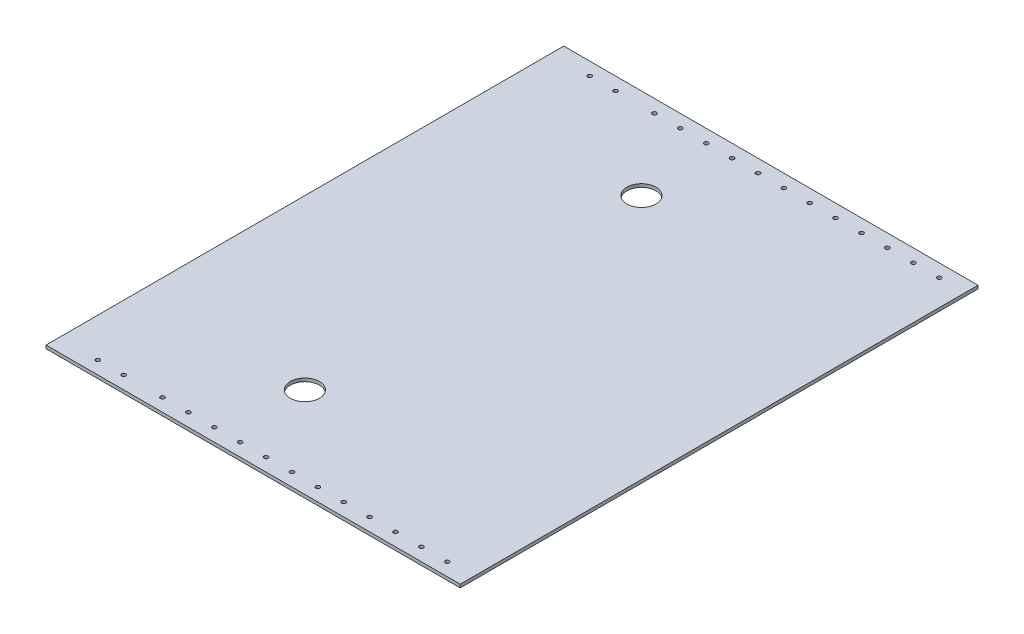
ISO-10303-21;
HEADER;
FILE_DESCRIPTION(('STEP AP214'),'2;1');
FILE_NAME('part.step','',(''),(''),'','','');
FILE_SCHEMA(('AUTOMOTIVE_DESIGN { 1 0 10303 214 1 1 1 1 }'));
ENDSEC;
DATA;
#1=APPLICATION_CONTEXT('core data for automotive mechanical design processes');
#2=APPLICATION_PROTOCOL_DEFINITION('international standard','automotive_design',2000,#1);
#3=PRODUCT_CONTEXT('',#1,'mechanical');
#4=PRODUCT('Part','Part','',(#3));
#5=PRODUCT_RELATED_PRODUCT_CATEGORY('part','',(#4));
#6=PRODUCT_DEFINITION_FORMATION('','',#4);
#7=PRODUCT_DEFINITION_CONTEXT('part definition',#1,'design');
#8=PRODUCT_DEFINITION('design','',#6,#7);
#9=PRODUCT_DEFINITION_SHAPE('','',#8);
#10=(LENGTH_UNIT() NAMED_UNIT(*) SI_UNIT(.MILLI.,.METRE.));
#11=(NAMED_UNIT(*) PLANE_ANGLE_UNIT() SI_UNIT($,.RADIAN.));
#12=(NAMED_UNIT(*) SI_UNIT($,.STERADIAN.) SOLID_ANGLE_UNIT());
#13=UNCERTAINTY_MEASURE_WITH_UNIT(LENGTH_MEASURE(1.E-05),#10,'distance_accuracy_value','');
#14=(GEOMETRIC_REPRESENTATION_CONTEXT(3) GLOBAL_UNCERTAINTY_ASSIGNED_CONTEXT((#13)) GLOBAL_UNIT_ASSIGNED_CONTEXT((#10,
#11,#12)) REPRESENTATION_CONTEXT('',''));
#15=CARTESIAN_POINT('',(0.,0.,0.));
#16=DIRECTION('',(0.,0.,1.));
#17=DIRECTION('',(1.,0.,0.));
#18=AXIS2_PLACEMENT_3D('',#15,#16,#17);
#19=CARTESIAN_POINT('',(0.,3.175,0.));
#20=DIRECTION('',(0.,0.,-1.));
#21=DIRECTION('',(-1.,0.,0.));
#22=AXIS2_PLACEMENT_3D('',#19,#20,#21);
#23=PLANE('',#22);
#24=DIRECTION('',(0.,1.,0.));
#25=VECTOR('',#24,1.);
#26=CARTESIAN_POINT('',(165.1,3.175,0.));
#27=LINE('',#26,#25);
#28=CARTESIAN_POINT('',(165.1,0.,0.));
#29=VERTEX_POINT('',#28);
#30=CARTESIAN_POINT('',(165.1,3.175,0.));
#31=VERTEX_POINT('',#30);
#32=EDGE_CURVE('E274',#29,#31,#27,.T.);
#33=ORIENTED_EDGE('',*,*,#32,.F.);
#34=DIRECTION('',(1.,0.,0.));
#35=VECTOR('',#34,1.);
#36=CARTESIAN_POINT('',(0.,0.,0.));
#37=LINE('',#36,#35);
#38=CARTESIAN_POINT('',(571.5,0.,0.));
#39=VERTEX_POINT('',#38);
#40=EDGE_CURVE('E77',#29,#39,#37,.T.);
#41=ORIENTED_EDGE('',*,*,#40,.T.);
#42=DIRECTION('',(0.,-1.,0.));
#43=VECTOR('',#42,1.);
#44=CARTESIAN_POINT('',(571.5,3.175,0.));
#45=LINE('',#44,#43);
#46=CARTESIAN_POINT('',(571.5,3.175,0.));
#47=VERTEX_POINT('',#46);
#48=EDGE_CURVE('E39',#47,#39,#45,.T.);
#49=ORIENTED_EDGE('',*,*,#48,.F.);
#50=DIRECTION('',(1.,0.,0.));
#51=VECTOR('',#50,1.);
#52=CARTESIAN_POINT('',(0.,3.175,0.));
#53=LINE('',#52,#51);
#54=EDGE_CURVE('E85',#31,#47,#53,.T.);
#55=ORIENTED_EDGE('',*,*,#54,.F.);
#56=EDGE_LOOP('',(#33,#41,#49,#55));
#57=FACE_BOUND('',#56,.T.);
#58=ADVANCED_FACE('F32',(#57),#23,.F.);
#59=CARTESIAN_POINT('',(0.,3.175,-508.));
#60=DIRECTION('',(0.,0.,1.));
#61=DIRECTION('',(1.,0.,0.));
#62=AXIS2_PLACEMENT_3D('',#59,#60,#61);
#63=PLANE('',#62);
#64=DIRECTION('',(0.,-1.,0.));
#65=VECTOR('',#64,1.);
#66=CARTESIAN_POINT('',(165.1,3.175,-508.));
#67=LINE('',#66,#65);
#68=CARTESIAN_POINT('',(165.1,3.175,-508.));
#69=VERTEX_POINT('',#68);
#70=CARTESIAN_POINT('',(165.1,0.,-508.));
#71=VERTEX_POINT('',#70);
#72=EDGE_CURVE('E46',#69,#71,#67,.T.);
#73=ORIENTED_EDGE('',*,*,#72,.F.);
#74=DIRECTION('',(-1.,0.,0.));
#75=VECTOR('',#74,1.);
#76=CARTESIAN_POINT('',(0.,3.175,-508.));
#77=LINE('',#76,#75);
#78=CARTESIAN_POINT('',(571.5,3.175,-508.));
#79=VERTEX_POINT('',#78);
#80=EDGE_CURVE('E82',#79,#69,#77,.T.);
#81=ORIENTED_EDGE('',*,*,#80,.F.);
#82=DIRECTION('',(0.,-1.,0.));
#83=VECTOR('',#82,1.);
#84=CARTESIAN_POINT('',(571.5,3.175,-508.));
#85=LINE('',#84,#83);
#86=CARTESIAN_POINT('',(571.5,0.,-508.));
#87=VERTEX_POINT('',#86);
#88=EDGE_CURVE('E70',#79,#87,#85,.T.);
#89=ORIENTED_EDGE('',*,*,#88,.T.);
#90=DIRECTION('',(-1.,0.,0.));
#91=VECTOR('',#90,1.);
#92=CARTESIAN_POINT('',(0.,0.,-508.));
#93=LINE('',#92,#91);
#94=EDGE_CURVE('E76',#87,#71,#93,.T.);
#95=ORIENTED_EDGE('',*,*,#94,.T.);
#96=EDGE_LOOP('',(#73,#81,#89,#95));
#97=FACE_BOUND('',#96,.T.);
#98=ADVANCED_FACE('F81',(#97),#63,.F.);
#99=CARTESIAN_POINT('',(0.,3.175,0.));
#100=DIRECTION('',(0.,-1.,0.));
#101=DIRECTION('',(0.,0.,-1.));
#102=AXIS2_PLACEMENT_3D('',#99,#100,#101);
#103=PLANE('',#102);
#104=CARTESIAN_POINT('',(330.2,3.175,-88.9));
#105=DIRECTION('',(0.,1.,0.));
#106=DIRECTION('',(0.,0.,1.));
#107=AXIS2_PLACEMENT_3D('',#104,#105,#106);
#108=CIRCLE('',#107,14.2875);
#109=CARTESIAN_POINT('',(330.2,3.175,-74.6125));
#110=VERTEX_POINT('',#109);
#111=EDGE_CURVE('E93',#110,#110,#108,.T.);
#112=ORIENTED_EDGE('',*,*,#111,.F.);
#113=EDGE_LOOP('',(#112));
#114=FACE_BOUND('',#113,.T.);
#115=CARTESIAN_POINT('',(330.2,3.175,-419.1));
#116=DIRECTION('',(0.,1.,0.));
#117=DIRECTION('',(0.,0.,1.));
#118=AXIS2_PLACEMENT_3D('',#115,#116,#117);
#119=CIRCLE('',#118,14.2875);
#120=CARTESIAN_POINT('',(330.2,3.175,-404.8125));
#121=VERTEX_POINT('',#120);
#122=EDGE_CURVE('E100',#121,#121,#119,.T.);
#123=ORIENTED_EDGE('',*,*,#122,.F.);
#124=EDGE_LOOP('',(#123));
#125=FACE_BOUND('',#124,.T.);
#126=CARTESIAN_POINT('',(546.1,3.175,-495.3));
#127=DIRECTION('',(0.,1.,0.));
#128=DIRECTION('',(0.,0.,1.));
#129=AXIS2_PLACEMENT_3D('',#126,#127,#128);
#130=CIRCLE('',#129,2.01929999999992);
#131=CARTESIAN_POINT('',(546.1,3.175,-493.2807));
#132=VERTEX_POINT('',#131);
#133=EDGE_CURVE('E105',#132,#132,#130,.T.);
#134=ORIENTED_EDGE('',*,*,#133,.F.);
#135=EDGE_LOOP('',(#134));
#136=FACE_BOUND('',#135,.T.);
#137=CARTESIAN_POINT('',(546.1,3.175,-12.7));
#138=DIRECTION('',(0.,1.,0.));
#139=DIRECTION('',(0.,0.,-1.));
#140=AXIS2_PLACEMENT_3D('',#137,#138,#139);
#141=CIRCLE('',#140,2.01929999999992);
#142=CARTESIAN_POINT('',(546.1,3.175,-14.7192999999999));
#143=VERTEX_POINT('',#142);
#144=EDGE_CURVE('E207',#143,#143,#141,.T.);
#145=ORIENTED_EDGE('',*,*,#144,.F.);
#146=EDGE_LOOP('',(#145));
#147=FACE_BOUND('',#146,.T.);
#148=CARTESIAN_POINT('',(520.7,3.175,-12.7));
#149=DIRECTION('',(0.,1.,0.));
#150=DIRECTION('',(0.,0.,-1.));
#151=AXIS2_PLACEMENT_3D('',#148,#149,#150);
#152=CIRCLE('',#151,2.01929999999992);
#153=CARTESIAN_POINT('',(520.7,3.175,-14.7192999999999));
#154=VERTEX_POINT('',#153);
#155=EDGE_CURVE('E214',#154,#154,#152,.T.);
#156=ORIENTED_EDGE('',*,*,#155,.F.);
#157=EDGE_LOOP('',(#156));
#158=FACE_BOUND('',#157,.T.);
#159=CARTESIAN_POINT('',(495.3,3.175,-12.7));
#160=DIRECTION('',(0.,1.,0.));
#161=DIRECTION('',(0.,0.,-1.));
#162=AXIS2_PLACEMENT_3D('',#159,#160,#161);
#163=CIRCLE('',#162,2.01929999999992);
#164=CARTESIAN_POINT('',(495.3,3.175,-14.7192999999999));
#165=VERTEX_POINT('',#164);
#166=EDGE_CURVE('E220',#165,#165,#163,.T.);
#167=ORIENTED_EDGE('',*,*,#166,.F.);
#168=EDGE_LOOP('',(#167));
#169=FACE_BOUND('',#168,.T.);
#170=CARTESIAN_POINT('',(469.9,3.175,-12.7));
#171=DIRECTION('',(0.,1.,0.));
#172=DIRECTION('',(0.,0.,-1.));
#173=AXIS2_PLACEMENT_3D('',#170,#171,#172);
#174=CIRCLE('',#173,2.01929999999992);
#175=CARTESIAN_POINT('',(469.9,3.175,-14.7192999999999));
#176=VERTEX_POINT('',#175);
#177=EDGE_CURVE('E226',#176,#176,#174,.T.);
#178=ORIENTED_EDGE('',*,*,#177,.F.);
#179=EDGE_LOOP('',(#178));
#180=FACE_BOUND('',#179,.T.);
#181=CARTESIAN_POINT('',(444.5,3.175,-12.7));
#182=DIRECTION('',(0.,1.,0.));
#183=DIRECTION('',(0.,0.,-1.));
#184=AXIS2_PLACEMENT_3D('',#181,#182,#183);
#185=CIRCLE('',#184,2.01929999999992);
#186=CARTESIAN_POINT('',(444.5,3.175,-14.7192999999999));
#187=VERTEX_POINT('',#186);
#188=EDGE_CURVE('E232',#187,#187,#185,.T.);
#189=ORIENTED_EDGE('',*,*,#188,.F.);
#190=EDGE_LOOP('',(#189));
#191=FACE_BOUND('',#190,.T.);
#192=CARTESIAN_POINT('',(419.1,3.175,-12.7));
#193=DIRECTION('',(0.,1.,0.));
#194=DIRECTION('',(0.,0.,-1.));
#195=AXIS2_PLACEMENT_3D('',#192,#193,#194);
#196=CIRCLE('',#195,2.01929999999992);
#197=CARTESIAN_POINT('',(419.1,3.175,-14.7192999999999));
#198=VERTEX_POINT('',#197);
#199=EDGE_CURVE('E238',#198,#198,#196,.T.);
#200=ORIENTED_EDGE('',*,*,#199,.F.);
#201=EDGE_LOOP('',(#200));
#202=FACE_BOUND('',#201,.T.);
#203=CARTESIAN_POINT('',(393.7,3.175,-12.7));
#204=DIRECTION('',(0.,1.,0.));
#205=DIRECTION('',(0.,0.,-1.));
#206=AXIS2_PLACEMENT_3D('',#203,#204,#205);
#207=CIRCLE('',#206,2.01929999999992);
#208=CARTESIAN_POINT('',(393.7,3.175,-14.7192999999999));
#209=VERTEX_POINT('',#208);
#210=EDGE_CURVE('E244',#209,#209,#207,.T.);
#211=ORIENTED_EDGE('',*,*,#210,.F.);
#212=EDGE_LOOP('',(#211));
#213=FACE_BOUND('',#212,.T.);
#214=CARTESIAN_POINT('',(368.3,3.175,-12.7));
#215=DIRECTION('',(0.,1.,0.));
#216=DIRECTION('',(0.,0.,-1.));
#217=AXIS2_PLACEMENT_3D('',#214,#215,#216);
#218=CIRCLE('',#217,2.01929999999992);
#219=CARTESIAN_POINT('',(368.3,3.175,-14.7192999999999));
#220=VERTEX_POINT('',#219);
#221=EDGE_CURVE('E250',#220,#220,#218,.T.);
#222=ORIENTED_EDGE('',*,*,#221,.F.);
#223=EDGE_LOOP('',(#222));
#224=FACE_BOUND('',#223,.T.);
#225=CARTESIAN_POINT('',(342.9,3.175,-12.7));
#226=DIRECTION('',(0.,1.,0.));
#227=DIRECTION('',(0.,0.,-1.));
#228=AXIS2_PLACEMENT_3D('',#225,#226,#227);
#229=CIRCLE('',#228,2.01929999999992);
#230=CARTESIAN_POINT('',(342.9,3.175,-14.7192999999999));
#231=VERTEX_POINT('',#230);
#232=EDGE_CURVE('E256',#231,#231,#229,.T.);
#233=ORIENTED_EDGE('',*,*,#232,.F.);
#234=EDGE_LOOP('',(#233));
#235=FACE_BOUND('',#234,.T.);
#236=CARTESIAN_POINT('',(317.5,3.175,-12.7));
#237=DIRECTION('',(0.,1.,0.));
#238=DIRECTION('',(0.,0.,-1.));
#239=AXIS2_PLACEMENT_3D('',#236,#237,#238);
#240=CIRCLE('',#239,2.01929999999992);
#241=CARTESIAN_POINT('',(317.5,3.175,-14.7192999999999));
#242=VERTEX_POINT('',#241);
#243=EDGE_CURVE('E262',#242,#242,#240,.T.);
#244=ORIENTED_EDGE('',*,*,#243,.F.);
#245=EDGE_LOOP('',(#244));
#246=FACE_BOUND('',#245,.T.);
#247=CARTESIAN_POINT('',(292.1,3.175,-12.7));
#248=DIRECTION('',(0.,1.,0.));
#249=DIRECTION('',(0.,0.,-1.));
#250=AXIS2_PLACEMENT_3D('',#247,#248,#249);
#251=CIRCLE('',#250,2.01929999999992);
#252=CARTESIAN_POINT('',(292.1,3.175,-14.7192999999999));
#253=VERTEX_POINT('',#252);
#254=EDGE_CURVE('E268',#253,#253,#251,.T.);
#255=ORIENTED_EDGE('',*,*,#254,.F.);
#256=EDGE_LOOP('',(#255));
#257=FACE_BOUND('',#256,.T.);
#258=CARTESIAN_POINT('',(368.3,3.175,-495.3));
#259=DIRECTION('',(0.,1.,0.));
#260=DIRECTION('',(0.,0.,1.));
#261=AXIS2_PLACEMENT_3D('',#258,#259,#260);
#262=CIRCLE('',#261,2.01929999999992);
#263=CARTESIAN_POINT('',(368.3,3.175,-493.2807));
#264=VERTEX_POINT('',#263);
#265=EDGE_CURVE('E135',#264,#264,#262,.T.);
#266=ORIENTED_EDGE('',*,*,#265,.F.);
#267=EDGE_LOOP('',(#266));
#268=FACE_BOUND('',#267,.T.);
#269=CARTESIAN_POINT('',(393.7,3.175,-495.3));
#270=DIRECTION('',(0.,1.,0.));
#271=DIRECTION('',(0.,0.,1.));
#272=AXIS2_PLACEMENT_3D('',#269,#270,#271);
#273=CIRCLE('',#272,2.01929999999992);
#274=CARTESIAN_POINT('',(393.7,3.175,-493.2807));
#275=VERTEX_POINT('',#274);
#276=EDGE_CURVE('E142',#275,#275,#273,.T.);
#277=ORIENTED_EDGE('',*,*,#276,.F.);
#278=EDGE_LOOP('',(#277));
#279=FACE_BOUND('',#278,.T.);
#280=CARTESIAN_POINT('',(419.1,3.175,-495.3));
#281=DIRECTION('',(0.,1.,0.));
#282=DIRECTION('',(0.,0.,1.));
#283=AXIS2_PLACEMENT_3D('',#280,#281,#282);
#284=CIRCLE('',#283,2.01929999999992);
#285=CARTESIAN_POINT('',(419.1,3.175,-493.2807));
#286=VERTEX_POINT('',#285);
#287=EDGE_CURVE('E148',#286,#286,#284,.T.);
#288=ORIENTED_EDGE('',*,*,#287,.F.);
#289=EDGE_LOOP('',(#288));
#290=FACE_BOUND('',#289,.T.);
#291=CARTESIAN_POINT('',(444.5,3.175,-495.3));
#292=DIRECTION('',(0.,1.,0.));
#293=DIRECTION('',(0.,0.,1.));
#294=AXIS2_PLACEMENT_3D('',#291,#292,#293);
#295=CIRCLE('',#294,2.01929999999992);
#296=CARTESIAN_POINT('',(444.5,3.175,-493.2807));
#297=VERTEX_POINT('',#296);
#298=EDGE_CURVE('E154',#297,#297,#295,.T.);
#299=ORIENTED_EDGE('',*,*,#298,.F.);
#300=EDGE_LOOP('',(#299));
#301=FACE_BOUND('',#300,.T.);
#302=CARTESIAN_POINT('',(228.6,3.175,-495.3));
#303=DIRECTION('',(0.,1.,0.));
#304=DIRECTION('',(0.,0.,1.));
#305=AXIS2_PLACEMENT_3D('',#302,#303,#304);
#306=CIRCLE('',#305,2.0193);
#307=CARTESIAN_POINT('',(228.6,3.175,-493.2807));
#308=VERTEX_POINT('',#307);
#309=EDGE_CURVE('E118',#308,#308,#306,.T.);
#310=ORIENTED_EDGE('',*,*,#309,.F.);
#311=EDGE_LOOP('',(#310));
#312=FACE_BOUND('',#311,.T.);
#313=CARTESIAN_POINT('',(520.7,3.175,-495.3));
#314=DIRECTION('',(0.,1.,0.));
#315=DIRECTION('',(0.,0.,1.));
#316=AXIS2_PLACEMENT_3D('',#313,#314,#315);
#317=CIRCLE('',#316,2.01929999999992);
#318=CARTESIAN_POINT('',(520.7,3.175,-493.2807));
#319=VERTEX_POINT('',#318);
#320=EDGE_CURVE('E111',#319,#319,#317,.T.);
#321=ORIENTED_EDGE('',*,*,#320,.F.);
#322=EDGE_LOOP('',(#321));
#323=FACE_BOUND('',#322,.T.);
#324=CARTESIAN_POINT('',(495.3,3.175,-495.3));
#325=DIRECTION('',(0.,1.,0.));
#326=DIRECTION('',(0.,0.,1.));
#327=AXIS2_PLACEMENT_3D('',#324,#325,#326);
#328=CIRCLE('',#327,2.01929999999992);
#329=CARTESIAN_POINT('',(495.3,3.175,-493.2807));
#330=VERTEX_POINT('',#329);
#331=EDGE_CURVE('E130',#330,#330,#328,.T.);
#332=ORIENTED_EDGE('',*,*,#331,.F.);
#333=EDGE_LOOP('',(#332));
#334=FACE_BOUND('',#333,.T.);
#335=CARTESIAN_POINT('',(469.9,3.175,-495.3));
#336=DIRECTION('',(0.,1.,0.));
#337=DIRECTION('',(0.,0.,1.));
#338=AXIS2_PLACEMENT_3D('',#335,#336,#337);
#339=CIRCLE('',#338,2.01929999999992);
#340=CARTESIAN_POINT('',(469.9,3.175,-493.2807));
#341=VERTEX_POINT('',#340);
#342=EDGE_CURVE('E123',#341,#341,#339,.T.);
#343=ORIENTED_EDGE('',*,*,#342,.F.);
#344=EDGE_LOOP('',(#343));
#345=FACE_BOUND('',#344,.T.);
#346=CARTESIAN_POINT('',(266.7,3.175,-12.7));
#347=DIRECTION('',(0.,1.,0.));
#348=DIRECTION('',(0.,0.,-1.));
#349=AXIS2_PLACEMENT_3D('',#346,#347,#348);
#350=CIRCLE('',#349,2.01929999999992);
#351=CARTESIAN_POINT('',(266.7,3.175,-14.7192999999999));
#352=VERTEX_POINT('',#351);
#353=EDGE_CURVE('E183',#352,#352,#350,.T.);
#354=ORIENTED_EDGE('',*,*,#353,.F.);
#355=EDGE_LOOP('',(#354));
#356=FACE_BOUND('',#355,.T.);
#357=CARTESIAN_POINT('',(228.6,3.175,-12.7000000000001));
#358=DIRECTION('',(0.,1.,0.));
#359=DIRECTION('',(0.,0.,-1.));
#360=AXIS2_PLACEMENT_3D('',#357,#358,#359);
#361=CIRCLE('',#360,2.0193);
#362=CARTESIAN_POINT('',(228.6,3.175,-14.7193000000001));
#363=VERTEX_POINT('',#362);
#364=EDGE_CURVE('E190',#363,#363,#361,.T.);
#365=ORIENTED_EDGE('',*,*,#364,.F.);
#366=EDGE_LOOP('',(#365));
#367=FACE_BOUND('',#366,.T.);
#368=CARTESIAN_POINT('',(203.2,3.175,-12.7000000000001));
#369=DIRECTION('',(0.,1.,0.));
#370=DIRECTION('',(0.,0.,-1.));
#371=AXIS2_PLACEMENT_3D('',#368,#369,#370);
#372=CIRCLE('',#371,2.0193);
#373=CARTESIAN_POINT('',(203.2,3.175,-14.7193000000001));
#374=VERTEX_POINT('',#373);
#375=EDGE_CURVE('E196',#374,#374,#372,.T.);
#376=ORIENTED_EDGE('',*,*,#375,.F.);
#377=EDGE_LOOP('',(#376));
#378=FACE_BOUND('',#377,.T.);
#379=CARTESIAN_POINT('',(203.2,3.175,-495.3));
#380=DIRECTION('',(0.,1.,0.));
#381=DIRECTION('',(0.,0.,1.));
#382=AXIS2_PLACEMENT_3D('',#379,#380,#381);
#383=CIRCLE('',#382,2.0193);
#384=CARTESIAN_POINT('',(203.2,3.175,-493.2807));
#385=VERTEX_POINT('',#384);
#386=EDGE_CURVE('E202',#385,#385,#383,.T.);
#387=ORIENTED_EDGE('',*,*,#386,.F.);
#388=EDGE_LOOP('',(#387));
#389=FACE_BOUND('',#388,.T.);
#390=CARTESIAN_POINT('',(266.7,3.175,-495.3));
#391=DIRECTION('',(0.,1.,0.));
#392=DIRECTION('',(0.,0.,1.));
#393=AXIS2_PLACEMENT_3D('',#390,#391,#392);
#394=CIRCLE('',#393,2.01929999999992);
#395=CARTESIAN_POINT('',(266.7,3.175,-493.2807));
#396=VERTEX_POINT('',#395);
#397=EDGE_CURVE('E159',#396,#396,#394,.T.);
#398=ORIENTED_EDGE('',*,*,#397,.F.);
#399=EDGE_LOOP('',(#398));
#400=FACE_BOUND('',#399,.T.);
#401=CARTESIAN_POINT('',(292.1,3.175,-495.3));
#402=DIRECTION('',(0.,1.,0.));
#403=DIRECTION('',(0.,0.,1.));
#404=AXIS2_PLACEMENT_3D('',#401,#402,#403);
#405=CIRCLE('',#404,2.01929999999992);
#406=CARTESIAN_POINT('',(292.1,3.175,-493.2807));
#407=VERTEX_POINT('',#406);
#408=EDGE_CURVE('E166',#407,#407,#405,.T.);
#409=ORIENTED_EDGE('',*,*,#408,.F.);
#410=EDGE_LOOP('',(#409));
#411=FACE_BOUND('',#410,.T.);
#412=CARTESIAN_POINT('',(317.5,3.175,-495.3));
#413=DIRECTION('',(0.,1.,0.));
#414=DIRECTION('',(0.,0.,1.));
#415=AXIS2_PLACEMENT_3D('',#412,#413,#414);
#416=CIRCLE('',#415,2.01929999999992);
#417=CARTESIAN_POINT('',(317.5,3.175,-493.2807));
#418=VERTEX_POINT('',#417);
#419=EDGE_CURVE('E172',#418,#418,#416,.T.);
#420=ORIENTED_EDGE('',*,*,#419,.F.);
#421=EDGE_LOOP('',(#420));
#422=FACE_BOUND('',#421,.T.);
#423=CARTESIAN_POINT('',(342.9,3.175,-495.3));
#424=DIRECTION('',(0.,1.,0.));
#425=DIRECTION('',(0.,0.,1.));
#426=AXIS2_PLACEMENT_3D('',#423,#424,#425);
#427=CIRCLE('',#426,2.01929999999992);
#428=CARTESIAN_POINT('',(342.9,3.175,-493.2807));
#429=VERTEX_POINT('',#428);
#430=EDGE_CURVE('E178',#429,#429,#427,.T.);
#431=ORIENTED_EDGE('',*,*,#430,.F.);
#432=EDGE_LOOP('',(#431));
#433=FACE_BOUND('',#432,.T.);
#434=DIRECTION('',(0.,0.,-1.));
#435=VECTOR('',#434,1.);
#436=CARTESIAN_POINT('',(165.1,3.175,0.));
#437=LINE('',#436,#435);
#438=EDGE_CURVE('E211',#31,#69,#437,.T.);
#439=ORIENTED_EDGE('',*,*,#438,.F.);
#440=ORIENTED_EDGE('',*,*,#54,.T.);
#441=DIRECTION('',(0.,0.,-1.));
#442=VECTOR('',#441,1.);
#443=CARTESIAN_POINT('',(571.5,3.175,0.));
#444=LINE('',#443,#442);
#445=EDGE_CURVE('E54',#47,#79,#444,.T.);
#446=ORIENTED_EDGE('',*,*,#445,.T.);
#447=ORIENTED_EDGE('',*,*,#80,.T.);
#448=EDGE_LOOP('',(#439,#440,#446,#447));
#449=FACE_BOUND('',#448,.T.);
#450=ADVANCED_FACE('F284',(#114,#125,#136,#147,#158,#169,#180,#191,#202,#213,#224,#235,#246,
#257,#268,#279,#290,#301,#312,#323,#334,#345,#356,#367,#378,#389,#400,#411,#422,#433,#449),#103,.F.);
#451=CARTESIAN_POINT('',(0.,0.,0.));
#452=DIRECTION('',(0.,-1.,0.));
#453=DIRECTION('',(0.,0.,-1.));
#454=AXIS2_PLACEMENT_3D('',#451,#452,#453);
#455=PLANE('',#454);
#456=CARTESIAN_POINT('',(342.9,0.,-495.3));
#457=DIRECTION('',(0.,1.,0.));
#458=DIRECTION('',(0.,0.,1.));
#459=AXIS2_PLACEMENT_3D('',#456,#457,#458);
#460=CIRCLE('',#459,2.01929999999992);
#461=CARTESIAN_POINT('',(342.9,0.,-493.2807));
#462=VERTEX_POINT('',#461);
#463=EDGE_CURVE('E139',#462,#462,#460,.T.);
#464=ORIENTED_EDGE('',*,*,#463,.T.);
#465=EDGE_LOOP('',(#464));
#466=FACE_BOUND('',#465,.T.);
#467=CARTESIAN_POINT('',(317.5,0.,-495.3));
#468=DIRECTION('',(0.,1.,0.));
#469=DIRECTION('',(0.,0.,1.));
#470=AXIS2_PLACEMENT_3D('',#467,#468,#469);
#471=CIRCLE('',#470,2.01929999999992);
#472=CARTESIAN_POINT('',(317.5,0.,-493.2807));
#473=VERTEX_POINT('',#472);
#474=EDGE_CURVE('E175',#473,#473,#471,.T.);
#475=ORIENTED_EDGE('',*,*,#474,.T.);
#476=EDGE_LOOP('',(#475));
#477=FACE_BOUND('',#476,.T.);
#478=CARTESIAN_POINT('',(292.1,0.,-495.3));
#479=DIRECTION('',(0.,1.,0.));
#480=DIRECTION('',(0.,0.,1.));
#481=AXIS2_PLACEMENT_3D('',#478,#479,#480);
#482=CIRCLE('',#481,2.01929999999992);
#483=CARTESIAN_POINT('',(292.1,0.,-493.2807));
#484=VERTEX_POINT('',#483);
#485=EDGE_CURVE('E169',#484,#484,#482,.T.);
#486=ORIENTED_EDGE('',*,*,#485,.T.);
#487=EDGE_LOOP('',(#486));
#488=FACE_BOUND('',#487,.T.);
#489=CARTESIAN_POINT('',(266.7,0.,-495.3));
#490=DIRECTION('',(0.,1.,0.));
#491=DIRECTION('',(0.,0.,1.));
#492=AXIS2_PLACEMENT_3D('',#489,#490,#491);
#493=CIRCLE('',#492,2.01929999999992);
#494=CARTESIAN_POINT('',(266.7,0.,-493.2807));
#495=VERTEX_POINT('',#494);
#496=EDGE_CURVE('E162',#495,#495,#493,.T.);
#497=ORIENTED_EDGE('',*,*,#496,.T.);
#498=EDGE_LOOP('',(#497));
#499=FACE_BOUND('',#498,.T.);
#500=CARTESIAN_POINT('',(203.2,0.,-495.3));
#501=DIRECTION('',(0.,1.,0.));
#502=DIRECTION('',(0.,0.,1.));
#503=AXIS2_PLACEMENT_3D('',#500,#501,#502);
#504=CIRCLE('',#503,2.0193);
#505=CARTESIAN_POINT('',(203.2,0.,-493.2807));
#506=VERTEX_POINT('',#505);
#507=EDGE_CURVE('E163',#506,#506,#504,.T.);
#508=ORIENTED_EDGE('',*,*,#507,.T.);
#509=EDGE_LOOP('',(#508));
#510=FACE_BOUND('',#509,.T.);
#511=CARTESIAN_POINT('',(203.2,0.,-12.7000000000001));
#512=DIRECTION('',(0.,1.,0.));
#513=DIRECTION('',(0.,0.,-1.));
#514=AXIS2_PLACEMENT_3D('',#511,#512,#513);
#515=CIRCLE('',#514,2.0193);
#516=CARTESIAN_POINT('',(203.2,0.,-14.7193000000001));
#517=VERTEX_POINT('',#516);
#518=EDGE_CURVE('E199',#517,#517,#515,.T.);
#519=ORIENTED_EDGE('',*,*,#518,.T.);
#520=EDGE_LOOP('',(#519));
#521=FACE_BOUND('',#520,.T.);
#522=CARTESIAN_POINT('',(228.6,0.,-12.7000000000001));
#523=DIRECTION('',(0.,1.,0.));
#524=DIRECTION('',(0.,0.,-1.));
#525=AXIS2_PLACEMENT_3D('',#522,#523,#524);
#526=CIRCLE('',#525,2.0193);
#527=CARTESIAN_POINT('',(228.6,0.,-14.7193000000001));
#528=VERTEX_POINT('',#527);
#529=EDGE_CURVE('E193',#528,#528,#526,.T.);
#530=ORIENTED_EDGE('',*,*,#529,.T.);
#531=EDGE_LOOP('',(#530));
#532=FACE_BOUND('',#531,.T.);
#533=CARTESIAN_POINT('',(266.7,0.,-12.7));
#534=DIRECTION('',(0.,1.,0.));
#535=DIRECTION('',(0.,0.,-1.));
#536=AXIS2_PLACEMENT_3D('',#533,#534,#535);
#537=CIRCLE('',#536,2.01929999999992);
#538=CARTESIAN_POINT('',(266.7,0.,-14.7192999999999));
#539=VERTEX_POINT('',#538);
#540=EDGE_CURVE('E186',#539,#539,#537,.T.);
#541=ORIENTED_EDGE('',*,*,#540,.T.);
#542=EDGE_LOOP('',(#541));
#543=FACE_BOUND('',#542,.T.);
#544=CARTESIAN_POINT('',(469.9,0.,-495.3));
#545=DIRECTION('',(0.,1.,0.));
#546=DIRECTION('',(0.,0.,1.));
#547=AXIS2_PLACEMENT_3D('',#544,#545,#546);
#548=CIRCLE('',#547,2.01929999999992);
#549=CARTESIAN_POINT('',(469.9,0.,-493.2807));
#550=VERTEX_POINT('',#549);
#551=EDGE_CURVE('E126',#550,#550,#548,.T.);
#552=ORIENTED_EDGE('',*,*,#551,.T.);
#553=EDGE_LOOP('',(#552));
#554=FACE_BOUND('',#553,.T.);
#555=CARTESIAN_POINT('',(495.3,0.,-495.3));
#556=DIRECTION('',(0.,1.,0.));
#557=DIRECTION('',(0.,0.,1.));
#558=AXIS2_PLACEMENT_3D('',#555,#556,#557);
#559=CIRCLE('',#558,2.01929999999992);
#560=CARTESIAN_POINT('',(495.3,0.,-493.2807));
#561=VERTEX_POINT('',#560);
#562=EDGE_CURVE('E115',#561,#561,#559,.T.);
#563=ORIENTED_EDGE('',*,*,#562,.T.);
#564=EDGE_LOOP('',(#563));
#565=FACE_BOUND('',#564,.T.);
#566=CARTESIAN_POINT('',(520.7,0.,-495.3));
#567=DIRECTION('',(0.,1.,0.));
#568=DIRECTION('',(0.,0.,1.));
#569=AXIS2_PLACEMENT_3D('',#566,#567,#568);
#570=CIRCLE('',#569,2.01929999999992);
#571=CARTESIAN_POINT('',(520.7,0.,-493.2807));
#572=VERTEX_POINT('',#571);
#573=EDGE_CURVE('E114',#572,#572,#570,.T.);
#574=ORIENTED_EDGE('',*,*,#573,.T.);
#575=EDGE_LOOP('',(#574));
#576=FACE_BOUND('',#575,.T.);
#577=CARTESIAN_POINT('',(228.6,0.,-495.3));
#578=DIRECTION('',(0.,1.,0.));
#579=DIRECTION('',(0.,0.,1.));
#580=AXIS2_PLACEMENT_3D('',#577,#578,#579);
#581=CIRCLE('',#580,2.0193);
#582=CARTESIAN_POINT('',(228.6,0.,-493.2807));
#583=VERTEX_POINT('',#582);
#584=EDGE_CURVE('E108',#583,#583,#581,.T.);
#585=ORIENTED_EDGE('',*,*,#584,.T.);
#586=EDGE_LOOP('',(#585));
#587=FACE_BOUND('',#586,.T.);
#588=CARTESIAN_POINT('',(444.5,0.,-495.3));
#589=DIRECTION('',(0.,1.,0.));
#590=DIRECTION('',(0.,0.,1.));
#591=AXIS2_PLACEMENT_3D('',#588,#589,#590);
#592=CIRCLE('',#591,2.01929999999992);
#593=CARTESIAN_POINT('',(444.5,0.,-493.2807));
#594=VERTEX_POINT('',#593);
#595=EDGE_CURVE('E127',#594,#594,#592,.T.);
#596=ORIENTED_EDGE('',*,*,#595,.T.);
#597=EDGE_LOOP('',(#596));
#598=FACE_BOUND('',#597,.T.);
#599=CARTESIAN_POINT('',(419.1,0.,-495.3));
#600=DIRECTION('',(0.,1.,0.));
#601=DIRECTION('',(0.,0.,1.));
#602=AXIS2_PLACEMENT_3D('',#599,#600,#601);
#603=CIRCLE('',#602,2.01929999999992);
#604=CARTESIAN_POINT('',(419.1,0.,-493.2807));
#605=VERTEX_POINT('',#604);
#606=EDGE_CURVE('E151',#605,#605,#603,.T.);
#607=ORIENTED_EDGE('',*,*,#606,.T.);
#608=EDGE_LOOP('',(#607));
#609=FACE_BOUND('',#608,.T.);
#610=CARTESIAN_POINT('',(393.7,0.,-495.3));
#611=DIRECTION('',(0.,1.,0.));
#612=DIRECTION('',(0.,0.,1.));
#613=AXIS2_PLACEMENT_3D('',#610,#611,#612);
#614=CIRCLE('',#613,2.01929999999992);
#615=CARTESIAN_POINT('',(393.7,0.,-493.2807));
#616=VERTEX_POINT('',#615);
#617=EDGE_CURVE('E145',#616,#616,#614,.T.);
#618=ORIENTED_EDGE('',*,*,#617,.T.);
#619=EDGE_LOOP('',(#618));
#620=FACE_BOUND('',#619,.T.);
#621=CARTESIAN_POINT('',(368.3,0.,-495.3));
#622=DIRECTION('',(0.,1.,0.));
#623=DIRECTION('',(0.,0.,1.));
#624=AXIS2_PLACEMENT_3D('',#621,#622,#623);
#625=CIRCLE('',#624,2.01929999999992);
#626=CARTESIAN_POINT('',(368.3,0.,-493.2807));
#627=VERTEX_POINT('',#626);
#628=EDGE_CURVE('E138',#627,#627,#625,.T.);
#629=ORIENTED_EDGE('',*,*,#628,.T.);
#630=EDGE_LOOP('',(#629));
#631=FACE_BOUND('',#630,.T.);
#632=CARTESIAN_POINT('',(292.1,0.,-12.7));
#633=DIRECTION('',(0.,1.,0.));
#634=DIRECTION('',(0.,0.,-1.));
#635=AXIS2_PLACEMENT_3D('',#632,#633,#634);
#636=CIRCLE('',#635,2.01929999999992);
#637=CARTESIAN_POINT('',(292.1,0.,-14.7192999999999));
#638=VERTEX_POINT('',#637);
#639=EDGE_CURVE('E187',#638,#638,#636,.T.);
#640=ORIENTED_EDGE('',*,*,#639,.T.);
#641=EDGE_LOOP('',(#640));
#642=FACE_BOUND('',#641,.T.);
#643=CARTESIAN_POINT('',(317.5,0.,-12.7));
#644=DIRECTION('',(0.,1.,0.));
#645=DIRECTION('',(0.,0.,-1.));
#646=AXIS2_PLACEMENT_3D('',#643,#644,#645);
#647=CIRCLE('',#646,2.01929999999992);
#648=CARTESIAN_POINT('',(317.5,0.,-14.7192999999999));
#649=VERTEX_POINT('',#648);
#650=EDGE_CURVE('E265',#649,#649,#647,.T.);
#651=ORIENTED_EDGE('',*,*,#650,.T.);
#652=EDGE_LOOP('',(#651));
#653=FACE_BOUND('',#652,.T.);
#654=CARTESIAN_POINT('',(342.9,0.,-12.7));
#655=DIRECTION('',(0.,1.,0.));
#656=DIRECTION('',(0.,0.,-1.));
#657=AXIS2_PLACEMENT_3D('',#654,#655,#656);
#658=CIRCLE('',#657,2.01929999999992);
#659=CARTESIAN_POINT('',(342.9,0.,-14.7192999999999));
#660=VERTEX_POINT('',#659);
#661=EDGE_CURVE('E259',#660,#660,#658,.T.);
#662=ORIENTED_EDGE('',*,*,#661,.T.);
#663=EDGE_LOOP('',(#662));
#664=FACE_BOUND('',#663,.T.);
#665=CARTESIAN_POINT('',(368.3,0.,-12.7));
#666=DIRECTION('',(0.,1.,0.));
#667=DIRECTION('',(0.,0.,-1.));
#668=AXIS2_PLACEMENT_3D('',#665,#666,#667);
#669=CIRCLE('',#668,2.01929999999992);
#670=CARTESIAN_POINT('',(368.3,0.,-14.7192999999999));
#671=VERTEX_POINT('',#670);
#672=EDGE_CURVE('E253',#671,#671,#669,.T.);
#673=ORIENTED_EDGE('',*,*,#672,.T.);
#674=EDGE_LOOP('',(#673));
#675=FACE_BOUND('',#674,.T.);
#676=CARTESIAN_POINT('',(393.7,0.,-12.7));
#677=DIRECTION('',(0.,1.,0.));
#678=DIRECTION('',(0.,0.,-1.));
#679=AXIS2_PLACEMENT_3D('',#676,#677,#678);
#680=CIRCLE('',#679,2.01929999999992);
#681=CARTESIAN_POINT('',(393.7,0.,-14.7192999999999));
#682=VERTEX_POINT('',#681);
#683=EDGE_CURVE('E247',#682,#682,#680,.T.);
#684=ORIENTED_EDGE('',*,*,#683,.T.);
#685=EDGE_LOOP('',(#684));
#686=FACE_BOUND('',#685,.T.);
#687=CARTESIAN_POINT('',(419.1,0.,-12.7));
#688=DIRECTION('',(0.,1.,0.));
#689=DIRECTION('',(0.,0.,-1.));
#690=AXIS2_PLACEMENT_3D('',#687,#688,#689);
#691=CIRCLE('',#690,2.01929999999992);
#692=CARTESIAN_POINT('',(419.1,0.,-14.7192999999999));
#693=VERTEX_POINT('',#692);
#694=EDGE_CURVE('E241',#693,#693,#691,.T.);
#695=ORIENTED_EDGE('',*,*,#694,.T.);
#696=EDGE_LOOP('',(#695));
#697=FACE_BOUND('',#696,.T.);
#698=CARTESIAN_POINT('',(444.5,0.,-12.7));
#699=DIRECTION('',(0.,1.,0.));
#700=DIRECTION('',(0.,0.,-1.));
#701=AXIS2_PLACEMENT_3D('',#698,#699,#700);
#702=CIRCLE('',#701,2.01929999999992);
#703=CARTESIAN_POINT('',(444.5,0.,-14.7192999999999));
#704=VERTEX_POINT('',#703);
#705=EDGE_CURVE('E235',#704,#704,#702,.T.);
#706=ORIENTED_EDGE('',*,*,#705,.T.);
#707=EDGE_LOOP('',(#706));
#708=FACE_BOUND('',#707,.T.);
#709=CARTESIAN_POINT('',(469.9,0.,-12.7));
#710=DIRECTION('',(0.,1.,0.));
#711=DIRECTION('',(0.,0.,-1.));
#712=AXIS2_PLACEMENT_3D('',#709,#710,#711);
#713=CIRCLE('',#712,2.01929999999992);
#714=CARTESIAN_POINT('',(469.9,0.,-14.7192999999999));
#715=VERTEX_POINT('',#714);
#716=EDGE_CURVE('E229',#715,#715,#713,.T.);
#717=ORIENTED_EDGE('',*,*,#716,.T.);
#718=EDGE_LOOP('',(#717));
#719=FACE_BOUND('',#718,.T.);
#720=CARTESIAN_POINT('',(495.3,0.,-12.7));
#721=DIRECTION('',(0.,1.,0.));
#722=DIRECTION('',(0.,0.,-1.));
#723=AXIS2_PLACEMENT_3D('',#720,#721,#722);
#724=CIRCLE('',#723,2.01929999999992);
#725=CARTESIAN_POINT('',(495.3,0.,-14.7192999999999));
#726=VERTEX_POINT('',#725);
#727=EDGE_CURVE('E223',#726,#726,#724,.T.);
#728=ORIENTED_EDGE('',*,*,#727,.T.);
#729=EDGE_LOOP('',(#728));
#730=FACE_BOUND('',#729,.T.);
#731=CARTESIAN_POINT('',(520.7,0.,-12.7));
#732=DIRECTION('',(0.,1.,0.));
#733=DIRECTION('',(0.,0.,-1.));
#734=AXIS2_PLACEMENT_3D('',#731,#732,#733);
#735=CIRCLE('',#734,2.01929999999992);
#736=CARTESIAN_POINT('',(520.7,0.,-14.7192999999999));
#737=VERTEX_POINT('',#736);
#738=EDGE_CURVE('E217',#737,#737,#735,.T.);
#739=ORIENTED_EDGE('',*,*,#738,.T.);
#740=EDGE_LOOP('',(#739));
#741=FACE_BOUND('',#740,.T.);
#742=CARTESIAN_POINT('',(546.1,0.,-12.7));
#743=DIRECTION('',(0.,1.,0.));
#744=DIRECTION('',(0.,0.,-1.));
#745=AXIS2_PLACEMENT_3D('',#742,#743,#744);
#746=CIRCLE('',#745,2.01929999999992);
#747=CARTESIAN_POINT('',(546.1,0.,-14.7192999999999));
#748=VERTEX_POINT('',#747);
#749=EDGE_CURVE('E210',#748,#748,#746,.T.);
#750=ORIENTED_EDGE('',*,*,#749,.T.);
#751=EDGE_LOOP('',(#750));
#752=FACE_BOUND('',#751,.T.);
#753=CARTESIAN_POINT('',(546.1,0.,-495.3));
#754=DIRECTION('',(0.,1.,0.));
#755=DIRECTION('',(0.,0.,1.));
#756=AXIS2_PLACEMENT_3D('',#753,#754,#755);
#757=CIRCLE('',#756,2.01929999999992);
#758=CARTESIAN_POINT('',(546.1,0.,-493.2807));
#759=VERTEX_POINT('',#758);
#760=EDGE_CURVE('E97',#759,#759,#757,.T.);
#761=ORIENTED_EDGE('',*,*,#760,.T.);
#762=EDGE_LOOP('',(#761));
#763=FACE_BOUND('',#762,.T.);
#764=CARTESIAN_POINT('',(330.2,0.,-419.1));
#765=DIRECTION('',(0.,1.,0.));
#766=DIRECTION('',(0.,0.,1.));
#767=AXIS2_PLACEMENT_3D('',#764,#765,#766);
#768=CIRCLE('',#767,14.2875);
#769=CARTESIAN_POINT('',(330.2,0.,-404.8125));
#770=VERTEX_POINT('',#769);
#771=EDGE_CURVE('E90',#770,#770,#768,.T.);
#772=ORIENTED_EDGE('',*,*,#771,.T.);
#773=EDGE_LOOP('',(#772));
#774=FACE_BOUND('',#773,.T.);
#775=CARTESIAN_POINT('',(330.2,0.,-88.9));
#776=DIRECTION('',(0.,1.,0.));
#777=DIRECTION('',(0.,0.,1.));
#778=AXIS2_PLACEMENT_3D('',#775,#776,#777);
#779=CIRCLE('',#778,14.2875);
#780=CARTESIAN_POINT('',(330.2,0.,-74.6125));
#781=VERTEX_POINT('',#780);
#782=EDGE_CURVE('E96',#781,#781,#779,.T.);
#783=ORIENTED_EDGE('',*,*,#782,.T.);
#784=EDGE_LOOP('',(#783));
#785=FACE_BOUND('',#784,.T.);
#786=ORIENTED_EDGE('',*,*,#40,.F.);
#787=DIRECTION('',(0.,0.,-1.));
#788=VECTOR('',#787,1.);
#789=CARTESIAN_POINT('',(165.1,0.,0.));
#790=LINE('',#789,#788);
#791=EDGE_CURVE('E11',#29,#71,#790,.T.);
#792=ORIENTED_EDGE('',*,*,#791,.T.);
#793=ORIENTED_EDGE('',*,*,#94,.F.);
#794=DIRECTION('',(0.,0.,-1.));
#795=VECTOR('',#794,1.);
#796=CARTESIAN_POINT('',(571.5,0.,0.));
#797=LINE('',#796,#795);
#798=EDGE_CURVE('E67',#39,#87,#797,.T.);
#799=ORIENTED_EDGE('',*,*,#798,.F.);
#800=EDGE_LOOP('',(#786,#792,#793,#799));
#801=FACE_BOUND('',#800,.T.);
#802=ADVANCED_FACE('F84',(#466,#477,#488,#499,#510,#521,#532,#543,#554,#565,#576,#587,#598,#609,
#620,#631,#642,#653,#664,#675,#686,#697,#708,#719,#730,#741,#752,#763,#774,#785,#801),#455,.T.);
#803=CARTESIAN_POINT('',(571.5,3.175,0.));
#804=DIRECTION('',(-1.,0.,0.));
#805=DIRECTION('',(0.,0.,1.));
#806=AXIS2_PLACEMENT_3D('',#803,#804,#805);
#807=PLANE('',#806);
#808=ORIENTED_EDGE('',*,*,#798,.T.);
#809=ORIENTED_EDGE('',*,*,#88,.F.);
#810=ORIENTED_EDGE('',*,*,#445,.F.);
#811=ORIENTED_EDGE('',*,*,#48,.T.);
#812=EDGE_LOOP('',(#808,#809,#810,#811));
#813=FACE_BOUND('',#812,.T.);
#814=ADVANCED_FACE('F69',(#813),#807,.F.);
#815=CARTESIAN_POINT('',(330.2,0.,-88.9));
#816=DIRECTION('',(0.,1.,0.));
#817=DIRECTION('',(0.,0.,1.));
#818=AXIS2_PLACEMENT_3D('',#815,#816,#817);
#819=CYLINDRICAL_SURFACE('',#818,14.2875);
#820=ORIENTED_EDGE('',*,*,#782,.F.);
#821=EDGE_LOOP('',(#820));
#822=FACE_BOUND('',#821,.T.);
#823=ORIENTED_EDGE('',*,*,#111,.T.);
#824=EDGE_LOOP('',(#823));
#825=FACE_BOUND('',#824,.T.);
#826=ADVANCED_FACE('F299',(#822,#825),#819,.F.);
#827=CARTESIAN_POINT('',(330.2,0.,-419.1));
#828=DIRECTION('',(0.,1.,0.));
#829=DIRECTION('',(0.,0.,1.));
#830=AXIS2_PLACEMENT_3D('',#827,#828,#829);
#831=CYLINDRICAL_SURFACE('',#830,14.2875);
#832=ORIENTED_EDGE('',*,*,#771,.F.);
#833=EDGE_LOOP('',(#832));
#834=FACE_BOUND('',#833,.T.);
#835=ORIENTED_EDGE('',*,*,#122,.T.);
#836=EDGE_LOOP('',(#835));
#837=FACE_BOUND('',#836,.T.);
#838=ADVANCED_FACE('F304',(#834,#837),#831,.F.);
#839=CARTESIAN_POINT('',(546.1,0.,-495.3));
#840=DIRECTION('',(0.,1.,0.));
#841=DIRECTION('',(0.,0.,1.));
#842=AXIS2_PLACEMENT_3D('',#839,#840,#841);
#843=CYLINDRICAL_SURFACE('',#842,2.01929999999992);
#844=ORIENTED_EDGE('',*,*,#760,.F.);
#845=EDGE_LOOP('',(#844));
#846=FACE_BOUND('',#845,.T.);
#847=ORIENTED_EDGE('',*,*,#133,.T.);
#848=EDGE_LOOP('',(#847));
#849=FACE_BOUND('',#848,.T.);
#850=ADVANCED_FACE('F488',(#846,#849),#843,.F.);
#851=CARTESIAN_POINT('',(546.1,0.,-12.7));
#852=DIRECTION('',(0.,1.,0.));
#853=DIRECTION('',(0.,0.,1.));
#854=AXIS2_PLACEMENT_3D('',#851,#852,#853);
#855=CYLINDRICAL_SURFACE('',#854,2.01929999999992);
#856=ORIENTED_EDGE('',*,*,#749,.F.);
#857=EDGE_LOOP('',(#856));
#858=FACE_BOUND('',#857,.T.);
#859=ORIENTED_EDGE('',*,*,#144,.T.);
#860=EDGE_LOOP('',(#859));
#861=FACE_BOUND('',#860,.T.);
#862=ADVANCED_FACE('F491',(#858,#861),#855,.F.);
#863=CARTESIAN_POINT('',(520.7,0.,-12.7));
#864=DIRECTION('',(0.,1.,0.));
#865=DIRECTION('',(0.,0.,1.));
#866=AXIS2_PLACEMENT_3D('',#863,#864,#865);
#867=CYLINDRICAL_SURFACE('',#866,2.01929999999992);
#868=ORIENTED_EDGE('',*,*,#738,.F.);
#869=EDGE_LOOP('',(#868));
#870=FACE_BOUND('',#869,.T.);
#871=ORIENTED_EDGE('',*,*,#155,.T.);
#872=EDGE_LOOP('',(#871));
#873=FACE_BOUND('',#872,.T.);
#874=ADVANCED_FACE('F510',(#870,#873),#867,.F.);
#875=CARTESIAN_POINT('',(495.3,0.,-12.7));
#876=DIRECTION('',(0.,1.,0.));
#877=DIRECTION('',(0.,0.,1.));
#878=AXIS2_PLACEMENT_3D('',#875,#876,#877);
#879=CYLINDRICAL_SURFACE('',#878,2.01929999999992);
#880=ORIENTED_EDGE('',*,*,#727,.F.);
#881=EDGE_LOOP('',(#880));
#882=FACE_BOUND('',#881,.T.);
#883=ORIENTED_EDGE('',*,*,#166,.T.);
#884=EDGE_LOOP('',(#883));
#885=FACE_BOUND('',#884,.T.);
#886=ADVANCED_FACE('F518',(#882,#885),#879,.F.);
#887=CARTESIAN_POINT('',(469.9,0.,-12.7));
#888=DIRECTION('',(0.,1.,0.));
#889=DIRECTION('',(0.,0.,1.));
#890=AXIS2_PLACEMENT_3D('',#887,#888,#889);
#891=CYLINDRICAL_SURFACE('',#890,2.01929999999992);
#892=ORIENTED_EDGE('',*,*,#716,.F.);
#893=EDGE_LOOP('',(#892));
#894=FACE_BOUND('',#893,.T.);
#895=ORIENTED_EDGE('',*,*,#177,.T.);
#896=EDGE_LOOP('',(#895));
#897=FACE_BOUND('',#896,.T.);
#898=ADVANCED_FACE('F526',(#894,#897),#891,.F.);
#899=CARTESIAN_POINT('',(444.5,0.,-12.7));
#900=DIRECTION('',(0.,1.,0.));
#901=DIRECTION('',(0.,0.,1.));
#902=AXIS2_PLACEMENT_3D('',#899,#900,#901);
#903=CYLINDRICAL_SURFACE('',#902,2.01929999999992);
#904=ORIENTED_EDGE('',*,*,#705,.F.);
#905=EDGE_LOOP('',(#904));
#906=FACE_BOUND('',#905,.T.);
#907=ORIENTED_EDGE('',*,*,#188,.T.);
#908=EDGE_LOOP('',(#907));
#909=FACE_BOUND('',#908,.T.);
#910=ADVANCED_FACE('F534',(#906,#909),#903,.F.);
#911=CARTESIAN_POINT('',(419.1,0.,-12.7));
#912=DIRECTION('',(0.,1.,0.));
#913=DIRECTION('',(0.,0.,1.));
#914=AXIS2_PLACEMENT_3D('',#911,#912,#913);
#915=CYLINDRICAL_SURFACE('',#914,2.01929999999992);
#916=ORIENTED_EDGE('',*,*,#694,.F.);
#917=EDGE_LOOP('',(#916));
#918=FACE_BOUND('',#917,.T.);
#919=ORIENTED_EDGE('',*,*,#199,.T.);
#920=EDGE_LOOP('',(#919));
#921=FACE_BOUND('',#920,.T.);
#922=ADVANCED_FACE('F542',(#918,#921),#915,.F.);
#923=CARTESIAN_POINT('',(393.7,0.,-12.7));
#924=DIRECTION('',(0.,1.,0.));
#925=DIRECTION('',(0.,0.,1.));
#926=AXIS2_PLACEMENT_3D('',#923,#924,#925);
#927=CYLINDRICAL_SURFACE('',#926,2.01929999999992);
#928=ORIENTED_EDGE('',*,*,#683,.F.);
#929=EDGE_LOOP('',(#928));
#930=FACE_BOUND('',#929,.T.);
#931=ORIENTED_EDGE('',*,*,#210,.T.);
#932=EDGE_LOOP('',(#931));
#933=FACE_BOUND('',#932,.T.);
#934=ADVANCED_FACE('F550',(#930,#933),#927,.F.);
#935=CARTESIAN_POINT('',(368.3,0.,-12.7));
#936=DIRECTION('',(0.,1.,0.));
#937=DIRECTION('',(0.,0.,1.));
#938=AXIS2_PLACEMENT_3D('',#935,#936,#937);
#939=CYLINDRICAL_SURFACE('',#938,2.01929999999992);
#940=ORIENTED_EDGE('',*,*,#672,.F.);
#941=EDGE_LOOP('',(#940));
#942=FACE_BOUND('',#941,.T.);
#943=ORIENTED_EDGE('',*,*,#221,.T.);
#944=EDGE_LOOP('',(#943));
#945=FACE_BOUND('',#944,.T.);
#946=ADVANCED_FACE('F558',(#942,#945),#939,.F.);
#947=CARTESIAN_POINT('',(342.9,0.,-12.7));
#948=DIRECTION('',(0.,1.,0.));
#949=DIRECTION('',(0.,0.,1.));
#950=AXIS2_PLACEMENT_3D('',#947,#948,#949);
#951=CYLINDRICAL_SURFACE('',#950,2.01929999999992);
#952=ORIENTED_EDGE('',*,*,#661,.F.);
#953=EDGE_LOOP('',(#952));
#954=FACE_BOUND('',#953,.T.);
#955=ORIENTED_EDGE('',*,*,#232,.T.);
#956=EDGE_LOOP('',(#955));
#957=FACE_BOUND('',#956,.T.);
#958=ADVANCED_FACE('F566',(#954,#957),#951,.F.);
#959=CARTESIAN_POINT('',(317.5,0.,-12.7));
#960=DIRECTION('',(0.,1.,0.));
#961=DIRECTION('',(0.,0.,1.));
#962=AXIS2_PLACEMENT_3D('',#959,#960,#961);
#963=CYLINDRICAL_SURFACE('',#962,2.01929999999992);
#964=ORIENTED_EDGE('',*,*,#650,.F.);
#965=EDGE_LOOP('',(#964));
#966=FACE_BOUND('',#965,.T.);
#967=ORIENTED_EDGE('',*,*,#243,.T.);
#968=EDGE_LOOP('',(#967));
#969=FACE_BOUND('',#968,.T.);
#970=ADVANCED_FACE('F574',(#966,#969),#963,.F.);
#971=CARTESIAN_POINT('',(292.1,0.,-12.7));
#972=DIRECTION('',(0.,1.,0.));
#973=DIRECTION('',(0.,0.,1.));
#974=AXIS2_PLACEMENT_3D('',#971,#972,#973);
#975=CYLINDRICAL_SURFACE('',#974,2.01929999999992);
#976=ORIENTED_EDGE('',*,*,#639,.F.);
#977=EDGE_LOOP('',(#976));
#978=FACE_BOUND('',#977,.T.);
#979=ORIENTED_EDGE('',*,*,#254,.T.);
#980=EDGE_LOOP('',(#979));
#981=FACE_BOUND('',#980,.T.);
#982=ADVANCED_FACE('F471',(#978,#981),#975,.F.);
#983=CARTESIAN_POINT('',(368.3,0.,-495.3));
#984=DIRECTION('',(0.,1.,0.));
#985=DIRECTION('',(0.,0.,1.));
#986=AXIS2_PLACEMENT_3D('',#983,#984,#985);
#987=CYLINDRICAL_SURFACE('',#986,2.01929999999992);
#988=ORIENTED_EDGE('',*,*,#628,.F.);
#989=EDGE_LOOP('',(#988));
#990=FACE_BOUND('',#989,.T.);
#991=ORIENTED_EDGE('',*,*,#265,.T.);
#992=EDGE_LOOP('',(#991));
#993=FACE_BOUND('',#992,.T.);
#994=ADVANCED_FACE('F467',(#990,#993),#987,.F.);
#995=CARTESIAN_POINT('',(393.7,0.,-495.3));
#996=DIRECTION('',(0.,1.,0.));
#997=DIRECTION('',(0.,0.,1.));
#998=AXIS2_PLACEMENT_3D('',#995,#996,#997);
#999=CYLINDRICAL_SURFACE('',#998,2.01929999999992);
#1000=ORIENTED_EDGE('',*,*,#617,.F.);
#1001=EDGE_LOOP('',(#1000));
#1002=FACE_BOUND('',#1001,.T.);
#1003=ORIENTED_EDGE('',*,*,#276,.T.);
#1004=EDGE_LOOP('',(#1003));
#1005=FACE_BOUND('',#1004,.T.);
#1006=ADVANCED_FACE('F463',(#1002,#1005),#999,.F.);
#1007=CARTESIAN_POINT('',(419.1,0.,-495.3));
#1008=DIRECTION('',(0.,1.,0.));
#1009=DIRECTION('',(0.,0.,1.));
#1010=AXIS2_PLACEMENT_3D('',#1007,#1008,#1009);
#1011=CYLINDRICAL_SURFACE('',#1010,2.01929999999992);
#1012=ORIENTED_EDGE('',*,*,#606,.F.);
#1013=EDGE_LOOP('',(#1012));
#1014=FACE_BOUND('',#1013,.T.);
#1015=ORIENTED_EDGE('',*,*,#287,.T.);
#1016=EDGE_LOOP('',(#1015));
#1017=FACE_BOUND('',#1016,.T.);
#1018=ADVANCED_FACE('F459',(#1014,#1017),#1011,.F.);
#1019=CARTESIAN_POINT('',(444.5,0.,-495.3));
#1020=DIRECTION('',(0.,1.,0.));
#1021=DIRECTION('',(0.,0.,1.));
#1022=AXIS2_PLACEMENT_3D('',#1019,#1020,#1021);
#1023=CYLINDRICAL_SURFACE('',#1022,2.01929999999992);
#1024=ORIENTED_EDGE('',*,*,#595,.F.);
#1025=EDGE_LOOP('',(#1024));
#1026=FACE_BOUND('',#1025,.T.);
#1027=ORIENTED_EDGE('',*,*,#298,.T.);
#1028=EDGE_LOOP('',(#1027));
#1029=FACE_BOUND('',#1028,.T.);
#1030=ADVANCED_FACE('F455',(#1026,#1029),#1023,.F.);
#1031=CARTESIAN_POINT('',(228.6,0.,-495.3));
#1032=DIRECTION('',(0.,1.,0.));
#1033=DIRECTION('',(0.,0.,1.));
#1034=AXIS2_PLACEMENT_3D('',#1031,#1032,#1033);
#1035=CYLINDRICAL_SURFACE('',#1034,2.0193);
#1036=ORIENTED_EDGE('',*,*,#584,.F.);
#1037=EDGE_LOOP('',(#1036));
#1038=FACE_BOUND('',#1037,.T.);
#1039=ORIENTED_EDGE('',*,*,#309,.T.);
#1040=EDGE_LOOP('',(#1039));
#1041=FACE_BOUND('',#1040,.T.);
#1042=ADVANCED_FACE('F458',(#1038,#1041),#1035,.F.);
#1043=CARTESIAN_POINT('',(520.7,0.,-495.3));
#1044=DIRECTION('',(0.,1.,0.));
#1045=DIRECTION('',(0.,0.,1.));
#1046=AXIS2_PLACEMENT_3D('',#1043,#1044,#1045);
#1047=CYLINDRICAL_SURFACE('',#1046,2.01929999999992);
#1048=ORIENTED_EDGE('',*,*,#573,.F.);
#1049=EDGE_LOOP('',(#1048));
#1050=FACE_BOUND('',#1049,.T.);
#1051=ORIENTED_EDGE('',*,*,#320,.T.);
#1052=EDGE_LOOP('',(#1051));
#1053=FACE_BOUND('',#1052,.T.);
#1054=ADVANCED_FACE('F477',(#1050,#1053),#1047,.F.);
#1055=CARTESIAN_POINT('',(495.3,0.,-495.3));
#1056=DIRECTION('',(0.,1.,0.));
#1057=DIRECTION('',(0.,0.,1.));
#1058=AXIS2_PLACEMENT_3D('',#1055,#1056,#1057);
#1059=CYLINDRICAL_SURFACE('',#1058,2.01929999999992);
#1060=ORIENTED_EDGE('',*,*,#562,.F.);
#1061=EDGE_LOOP('',(#1060));
#1062=FACE_BOUND('',#1061,.T.);
#1063=ORIENTED_EDGE('',*,*,#331,.T.);
#1064=EDGE_LOOP('',(#1063));
#1065=FACE_BOUND('',#1064,.T.);
#1066=ADVANCED_FACE('F473',(#1062,#1065),#1059,.F.);
#1067=CARTESIAN_POINT('',(469.9,0.,-495.3));
#1068=DIRECTION('',(0.,1.,0.));
#1069=DIRECTION('',(0.,0.,1.));
#1070=AXIS2_PLACEMENT_3D('',#1067,#1068,#1069);
#1071=CYLINDRICAL_SURFACE('',#1070,2.01929999999992);
#1072=ORIENTED_EDGE('',*,*,#551,.F.);
#1073=EDGE_LOOP('',(#1072));
#1074=FACE_BOUND('',#1073,.T.);
#1075=ORIENTED_EDGE('',*,*,#342,.T.);
#1076=EDGE_LOOP('',(#1075));
#1077=FACE_BOUND('',#1076,.T.);
#1078=ADVANCED_FACE('F476',(#1074,#1077),#1071,.F.);
#1079=CARTESIAN_POINT('',(266.7,0.,-12.7));
#1080=DIRECTION('',(0.,1.,0.));
#1081=DIRECTION('',(0.,0.,1.));
#1082=AXIS2_PLACEMENT_3D('',#1079,#1080,#1081);
#1083=CYLINDRICAL_SURFACE('',#1082,2.01929999999992);
#1084=ORIENTED_EDGE('',*,*,#540,.F.);
#1085=EDGE_LOOP('',(#1084));
#1086=FACE_BOUND('',#1085,.T.);
#1087=ORIENTED_EDGE('',*,*,#353,.T.);
#1088=EDGE_LOOP('',(#1087));
#1089=FACE_BOUND('',#1088,.T.);
#1090=ADVANCED_FACE('F444',(#1086,#1089),#1083,.F.);
#1091=CARTESIAN_POINT('',(228.6,0.,-12.7000000000001));
#1092=DIRECTION('',(0.,1.,0.));
#1093=DIRECTION('',(0.,0.,1.));
#1094=AXIS2_PLACEMENT_3D('',#1091,#1092,#1093);
#1095=CYLINDRICAL_SURFACE('',#1094,2.0193);
#1096=ORIENTED_EDGE('',*,*,#529,.F.);
#1097=EDGE_LOOP('',(#1096));
#1098=FACE_BOUND('',#1097,.T.);
#1099=ORIENTED_EDGE('',*,*,#364,.T.);
#1100=EDGE_LOOP('',(#1099));
#1101=FACE_BOUND('',#1100,.T.);
#1102=ADVANCED_FACE('F628',(#1098,#1101),#1095,.F.);
#1103=CARTESIAN_POINT('',(203.2,0.,-12.7000000000001));
#1104=DIRECTION('',(0.,1.,0.));
#1105=DIRECTION('',(0.,0.,1.));
#1106=AXIS2_PLACEMENT_3D('',#1103,#1104,#1105);
#1107=CYLINDRICAL_SURFACE('',#1106,2.0193);
#1108=ORIENTED_EDGE('',*,*,#518,.F.);
#1109=EDGE_LOOP('',(#1108));
#1110=FACE_BOUND('',#1109,.T.);
#1111=ORIENTED_EDGE('',*,*,#375,.T.);
#1112=EDGE_LOOP('',(#1111));
#1113=FACE_BOUND('',#1112,.T.);
#1114=ADVANCED_FACE('F635',(#1110,#1113),#1107,.F.);
#1115=CARTESIAN_POINT('',(203.2,0.,-495.3));
#1116=DIRECTION('',(0.,1.,0.));
#1117=DIRECTION('',(0.,0.,1.));
#1118=AXIS2_PLACEMENT_3D('',#1115,#1116,#1117);
#1119=CYLINDRICAL_SURFACE('',#1118,2.0193);
#1120=ORIENTED_EDGE('',*,*,#507,.F.);
#1121=EDGE_LOOP('',(#1120));
#1122=FACE_BOUND('',#1121,.T.);
#1123=ORIENTED_EDGE('',*,*,#386,.T.);
#1124=EDGE_LOOP('',(#1123));
#1125=FACE_BOUND('',#1124,.T.);
#1126=ADVANCED_FACE('F453',(#1122,#1125),#1119,.F.);
#1127=CARTESIAN_POINT('',(266.7,0.,-495.3));
#1128=DIRECTION('',(0.,1.,0.));
#1129=DIRECTION('',(0.,0.,1.));
#1130=AXIS2_PLACEMENT_3D('',#1127,#1128,#1129);
#1131=CYLINDRICAL_SURFACE('',#1130,2.01929999999992);
#1132=ORIENTED_EDGE('',*,*,#496,.F.);
#1133=EDGE_LOOP('',(#1132));
#1134=FACE_BOUND('',#1133,.T.);
#1135=ORIENTED_EDGE('',*,*,#397,.T.);
#1136=EDGE_LOOP('',(#1135));
#1137=FACE_BOUND('',#1136,.T.);
#1138=ADVANCED_FACE('F449',(#1134,#1137),#1131,.F.);
#1139=CARTESIAN_POINT('',(292.1,0.,-495.3));
#1140=DIRECTION('',(0.,1.,0.));
#1141=DIRECTION('',(0.,0.,1.));
#1142=AXIS2_PLACEMENT_3D('',#1139,#1140,#1141);
#1143=CYLINDRICAL_SURFACE('',#1142,2.01929999999992);
#1144=ORIENTED_EDGE('',*,*,#485,.F.);
#1145=EDGE_LOOP('',(#1144));
#1146=FACE_BOUND('',#1145,.T.);
#1147=ORIENTED_EDGE('',*,*,#408,.T.);
#1148=EDGE_LOOP('',(#1147));
#1149=FACE_BOUND('',#1148,.T.);
#1150=ADVANCED_FACE('F440',(#1146,#1149),#1143,.F.);
#1151=CARTESIAN_POINT('',(317.5,0.,-495.3));
#1152=DIRECTION('',(0.,1.,0.));
#1153=DIRECTION('',(0.,0.,1.));
#1154=AXIS2_PLACEMENT_3D('',#1151,#1152,#1153);
#1155=CYLINDRICAL_SURFACE('',#1154,2.01929999999992);
#1156=ORIENTED_EDGE('',*,*,#474,.F.);
#1157=EDGE_LOOP('',(#1156));
#1158=FACE_BOUND('',#1157,.T.);
#1159=ORIENTED_EDGE('',*,*,#419,.T.);
#1160=EDGE_LOOP('',(#1159));
#1161=FACE_BOUND('',#1160,.T.);
#1162=ADVANCED_FACE('F432',(#1158,#1161),#1155,.F.);
#1163=CARTESIAN_POINT('',(342.9,0.,-495.3));
#1164=DIRECTION('',(0.,1.,0.));
#1165=DIRECTION('',(0.,0.,1.));
#1166=AXIS2_PLACEMENT_3D('',#1163,#1164,#1165);
#1167=CYLINDRICAL_SURFACE('',#1166,2.01929999999992);
#1168=ORIENTED_EDGE('',*,*,#463,.F.);
#1169=EDGE_LOOP('',(#1168));
#1170=FACE_BOUND('',#1169,.T.);
#1171=ORIENTED_EDGE('',*,*,#430,.T.);
#1172=EDGE_LOOP('',(#1171));
#1173=FACE_BOUND('',#1172,.T.);
#1174=ADVANCED_FACE('F430',(#1170,#1173),#1167,.F.);
#1175=CARTESIAN_POINT('',(165.1,0.,0.));
#1176=DIRECTION('',(-1.,0.,0.));
#1177=DIRECTION('',(0.,0.,1.));
#1178=AXIS2_PLACEMENT_3D('',#1175,#1176,#1177);
#1179=PLANE('',#1178);
#1180=ORIENTED_EDGE('',*,*,#438,.T.);
#1181=ORIENTED_EDGE('',*,*,#72,.T.);
#1182=ORIENTED_EDGE('',*,*,#791,.F.);
#1183=ORIENTED_EDGE('',*,*,#32,.T.);
#1184=EDGE_LOOP('',(#1180,#1181,#1182,#1183));
#1185=FACE_BOUND('',#1184,.T.);
#1186=ADVANCED_FACE('F279',(#1185),#1179,.T.);
#1187=CLOSED_SHELL('',(#58,#98,#450,#802,#814,#826,#838,#850,#862,#874,#886,#898,#910,#922,#934,
#946,#958,#970,#982,#994,#1006,#1018,#1030,#1042,#1054,#1066,#1078,#1090,#1102,#1114,#1126,
#1138,#1150,#1162,#1174,#1186));
#1188=MANIFOLD_SOLID_BREP('B2',#1187);
#1189=ADVANCED_BREP_SHAPE_REPRESENTATION('',(#18,#1188),#14);
#1190=SHAPE_DEFINITION_REPRESENTATION(#9,#1189);
ENDSEC;
END-ISO-10303-21;
